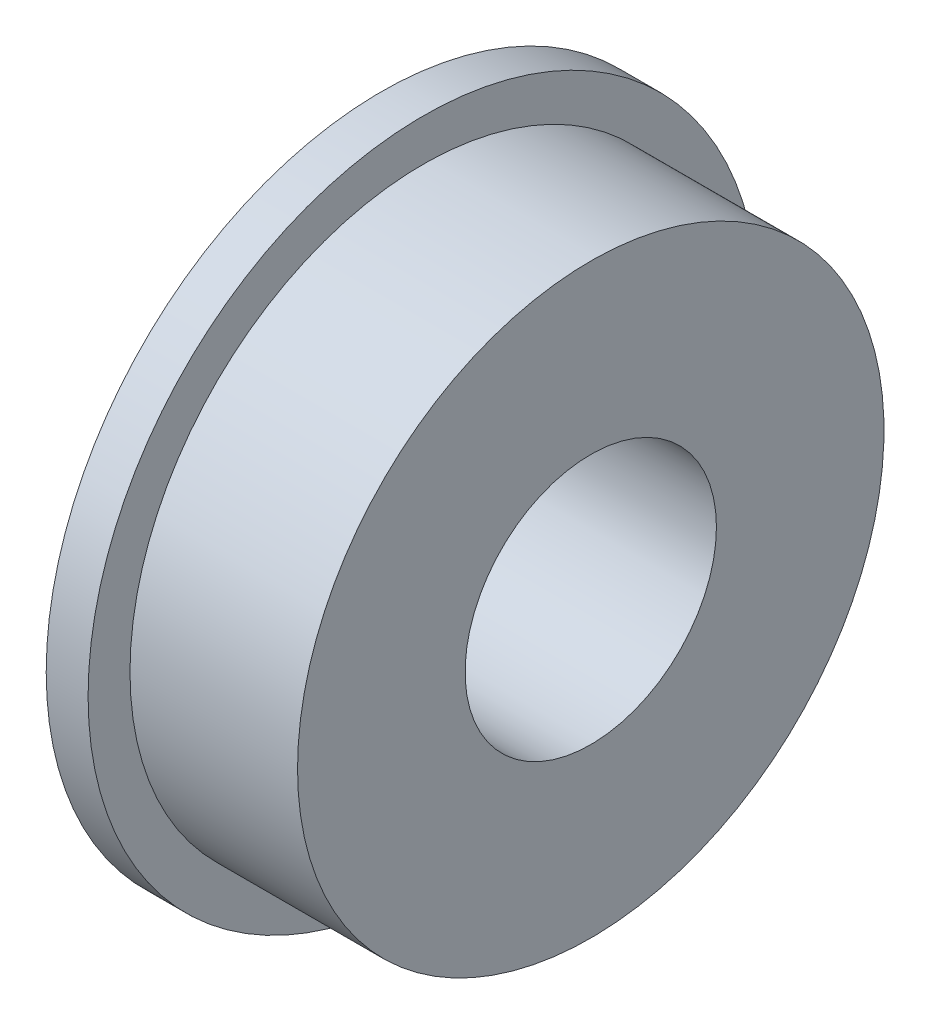
ISO-10303-21;
HEADER;
FILE_DESCRIPTION(('STEP AP214'),'2;1');
FILE_NAME('part.step','',(''),(''),'','','');
FILE_SCHEMA(('AUTOMOTIVE_DESIGN { 1 0 10303 214 1 1 1 1 }'));
ENDSEC;
DATA;
#1=APPLICATION_CONTEXT('core data for automotive mechanical design processes');
#2=APPLICATION_PROTOCOL_DEFINITION('international standard','automotive_design',2000,#1);
#3=PRODUCT_CONTEXT('',#1,'mechanical');
#4=PRODUCT('Part','Part','',(#3));
#5=PRODUCT_RELATED_PRODUCT_CATEGORY('part','',(#4));
#6=PRODUCT_DEFINITION_FORMATION('','',#4);
#7=PRODUCT_DEFINITION_CONTEXT('part definition',#1,'design');
#8=PRODUCT_DEFINITION('design','',#6,#7);
#9=PRODUCT_DEFINITION_SHAPE('','',#8);
#10=(LENGTH_UNIT() NAMED_UNIT(*) SI_UNIT(.MILLI.,.METRE.));
#11=(NAMED_UNIT(*) PLANE_ANGLE_UNIT() SI_UNIT($,.RADIAN.));
#12=(NAMED_UNIT(*) SI_UNIT($,.STERADIAN.) SOLID_ANGLE_UNIT());
#13=UNCERTAINTY_MEASURE_WITH_UNIT(LENGTH_MEASURE(1.E-05),#10,'distance_accuracy_value','');
#14=(GEOMETRIC_REPRESENTATION_CONTEXT(3) GLOBAL_UNCERTAINTY_ASSIGNED_CONTEXT((#13)) GLOBAL_UNIT_ASSIGNED_CONTEXT((#10,
#11,#12)) REPRESENTATION_CONTEXT('',''));
#15=CARTESIAN_POINT('',(0.,0.,0.));
#16=DIRECTION('',(0.,0.,1.));
#17=DIRECTION('',(1.,0.,0.));
#18=AXIS2_PLACEMENT_3D('',#15,#16,#17);
#19=CARTESIAN_POINT('',(3.175,0.,0.));
#20=DIRECTION('',(-1.,0.,0.));
#21=DIRECTION('',(0.,0.,-1.));
#22=AXIS2_PLACEMENT_3D('',#19,#20,#21);
#23=CYLINDRICAL_SURFACE('',#22,25.4);
#24=CARTESIAN_POINT('',(3.175,0.,0.));
#25=DIRECTION('',(-1.,0.,0.));
#26=DIRECTION('',(0.,0.,1.));
#27=AXIS2_PLACEMENT_3D('',#24,#25,#26);
#28=CIRCLE('',#27,25.4);
#29=CARTESIAN_POINT('',(3.175,0.,25.4));
#30=VERTEX_POINT('',#29);
#31=EDGE_CURVE('E40',#30,#30,#28,.T.);
#32=ORIENTED_EDGE('',*,*,#31,.T.);
#33=EDGE_LOOP('',(#32));
#34=FACE_BOUND('',#33,.T.);
#35=CARTESIAN_POINT('',(0.,0.,0.));
#36=DIRECTION('',(-1.,0.,0.));
#37=DIRECTION('',(0.,0.,1.));
#38=AXIS2_PLACEMENT_3D('',#35,#36,#37);
#39=CIRCLE('',#38,25.4);
#40=CARTESIAN_POINT('',(0.,0.,25.4));
#41=VERTEX_POINT('',#40);
#42=EDGE_CURVE('E36',#41,#41,#39,.T.);
#43=ORIENTED_EDGE('',*,*,#42,.F.);
#44=EDGE_LOOP('',(#43));
#45=FACE_BOUND('',#44,.T.);
#46=ADVANCED_FACE('F33',(#34,#45),#23,.T.);
#47=CARTESIAN_POINT('',(3.175,0.,0.));
#48=DIRECTION('',(1.,0.,0.));
#49=DIRECTION('',(0.,0.,1.));
#50=AXIS2_PLACEMENT_3D('',#47,#48,#49);
#51=PLANE('',#50);
#52=CARTESIAN_POINT('',(3.175,0.,0.));
#53=DIRECTION('',(-1.,0.,0.));
#54=DIRECTION('',(0.,0.,1.));
#55=AXIS2_PLACEMENT_3D('',#52,#53,#54);
#56=CIRCLE('',#55,22.225);
#57=CARTESIAN_POINT('',(3.175,0.,22.225));
#58=VERTEX_POINT('',#57);
#59=EDGE_CURVE('E10',#58,#58,#56,.T.);
#60=ORIENTED_EDGE('',*,*,#59,.T.);
#61=EDGE_LOOP('',(#60));
#62=FACE_BOUND('',#61,.T.);
#63=ORIENTED_EDGE('',*,*,#31,.F.);
#64=EDGE_LOOP('',(#63));
#65=FACE_BOUND('',#64,.T.);
#66=ADVANCED_FACE('F73',(#62,#65),#51,.T.);
#67=CARTESIAN_POINT('',(0.,0.,0.));
#68=DIRECTION('',(1.,0.,0.));
#69=DIRECTION('',(0.,0.,1.));
#70=AXIS2_PLACEMENT_3D('',#67,#68,#69);
#71=PLANE('',#70);
#72=CARTESIAN_POINT('',(0.,0.,0.));
#73=DIRECTION('',(1.,0.,0.));
#74=DIRECTION('',(0.,0.,-1.));
#75=AXIS2_PLACEMENT_3D('',#72,#73,#74);
#76=CIRCLE('',#75,9.525);
#77=CARTESIAN_POINT('',(0.,0.,-9.525));
#78=VERTEX_POINT('',#77);
#79=EDGE_CURVE('E50',#78,#78,#76,.T.);
#80=ORIENTED_EDGE('',*,*,#79,.T.);
#81=EDGE_LOOP('',(#80));
#82=FACE_BOUND('',#81,.T.);
#83=ORIENTED_EDGE('',*,*,#42,.T.);
#84=EDGE_LOOP('',(#83));
#85=FACE_BOUND('',#84,.T.);
#86=ADVANCED_FACE('F68',(#82,#85),#71,.F.);
#87=CARTESIAN_POINT('',(15.875,0.,0.));
#88=DIRECTION('',(-1.,0.,0.));
#89=DIRECTION('',(0.,0.,-1.));
#90=AXIS2_PLACEMENT_3D('',#87,#88,#89);
#91=CYLINDRICAL_SURFACE('',#90,22.225);
#92=CARTESIAN_POINT('',(15.875,0.,0.));
#93=DIRECTION('',(-1.,0.,0.));
#94=DIRECTION('',(0.,0.,1.));
#95=AXIS2_PLACEMENT_3D('',#92,#93,#94);
#96=CIRCLE('',#95,22.225);
#97=CARTESIAN_POINT('',(15.875,0.,22.225));
#98=VERTEX_POINT('',#97);
#99=EDGE_CURVE('E46',#98,#98,#96,.T.);
#100=ORIENTED_EDGE('',*,*,#99,.T.);
#101=EDGE_LOOP('',(#100));
#102=FACE_BOUND('',#101,.T.);
#103=ORIENTED_EDGE('',*,*,#59,.F.);
#104=EDGE_LOOP('',(#103));
#105=FACE_BOUND('',#104,.T.);
#106=ADVANCED_FACE('F62',(#102,#105),#91,.T.);
#107=CARTESIAN_POINT('',(15.875,0.,0.));
#108=DIRECTION('',(1.,0.,0.));
#109=DIRECTION('',(0.,0.,1.));
#110=AXIS2_PLACEMENT_3D('',#107,#108,#109);
#111=PLANE('',#110);
#112=CARTESIAN_POINT('',(15.875,0.,0.));
#113=DIRECTION('',(1.,0.,0.));
#114=DIRECTION('',(0.,0.,-1.));
#115=AXIS2_PLACEMENT_3D('',#112,#113,#114);
#116=CIRCLE('',#115,9.525);
#117=CARTESIAN_POINT('',(15.875,0.,-9.525));
#118=VERTEX_POINT('',#117);
#119=EDGE_CURVE('E49',#118,#118,#116,.T.);
#120=ORIENTED_EDGE('',*,*,#119,.F.);
#121=EDGE_LOOP('',(#120));
#122=FACE_BOUND('',#121,.T.);
#123=ORIENTED_EDGE('',*,*,#99,.F.);
#124=EDGE_LOOP('',(#123));
#125=FACE_BOUND('',#124,.T.);
#126=ADVANCED_FACE('F59',(#122,#125),#111,.T.);
#127=CARTESIAN_POINT('',(15.875,0.,0.));
#128=DIRECTION('',(-1.,0.,0.));
#129=DIRECTION('',(0.,0.,-1.));
#130=AXIS2_PLACEMENT_3D('',#127,#128,#129);
#131=CYLINDRICAL_SURFACE('',#130,9.525);
#132=ORIENTED_EDGE('',*,*,#119,.T.);
#133=EDGE_LOOP('',(#132));
#134=FACE_BOUND('',#133,.T.);
#135=ORIENTED_EDGE('',*,*,#79,.F.);
#136=EDGE_LOOP('',(#135));
#137=FACE_BOUND('',#136,.T.);
#138=ADVANCED_FACE('F56',(#134,#137),#131,.F.);
#139=CLOSED_SHELL('',(#46,#66,#86,#106,#126,#138));
#140=MANIFOLD_SOLID_BREP('B2',#139);
#141=ADVANCED_BREP_SHAPE_REPRESENTATION('',(#18,#140),#14);
#142=SHAPE_DEFINITION_REPRESENTATION(#9,#141);
ENDSEC;
END-ISO-10303-21;
